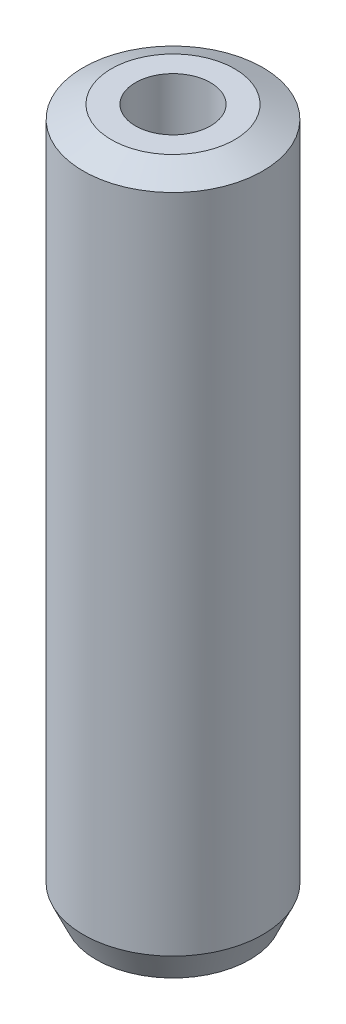
ISO-10303-21;
HEADER;
FILE_DESCRIPTION(('STEP AP214'),'2;1');
FILE_NAME('part.step','',(''),(''),'','','');
FILE_SCHEMA(('AUTOMOTIVE_DESIGN { 1 0 10303 214 1 1 1 1 }'));
ENDSEC;
DATA;
#1=APPLICATION_CONTEXT('core data for automotive mechanical design processes');
#2=APPLICATION_PROTOCOL_DEFINITION('international standard','automotive_design',2000,#1);
#3=PRODUCT_CONTEXT('',#1,'mechanical');
#4=PRODUCT('Part','Part','',(#3));
#5=PRODUCT_RELATED_PRODUCT_CATEGORY('part','',(#4));
#6=PRODUCT_DEFINITION_FORMATION('','',#4);
#7=PRODUCT_DEFINITION_CONTEXT('part definition',#1,'design');
#8=PRODUCT_DEFINITION('design','',#6,#7);
#9=PRODUCT_DEFINITION_SHAPE('','',#8);
#10=(LENGTH_UNIT() NAMED_UNIT(*) SI_UNIT(.MILLI.,.METRE.));
#11=(NAMED_UNIT(*) PLANE_ANGLE_UNIT() SI_UNIT($,.RADIAN.));
#12=(NAMED_UNIT(*) SI_UNIT($,.STERADIAN.) SOLID_ANGLE_UNIT());
#13=UNCERTAINTY_MEASURE_WITH_UNIT(LENGTH_MEASURE(1.E-05),#10,'distance_accuracy_value','');
#14=(GEOMETRIC_REPRESENTATION_CONTEXT(3) GLOBAL_UNCERTAINTY_ASSIGNED_CONTEXT((#13)) GLOBAL_UNIT_ASSIGNED_CONTEXT((#10,
#11,#12)) REPRESENTATION_CONTEXT('',''));
#15=CARTESIAN_POINT('',(0.,0.,0.));
#16=DIRECTION('',(0.,0.,1.));
#17=DIRECTION('',(1.,0.,0.));
#18=AXIS2_PLACEMENT_3D('',#15,#16,#17);
#19=CARTESIAN_POINT('',(0.,313.067838237132,0.));
#20=DIRECTION('',(0.,-1.,0.));
#21=DIRECTION('',(0.,0.,-1.));
#22=AXIS2_PLACEMENT_3D('',#19,#20,#21);
#23=CYLINDRICAL_SURFACE('',#22,40.);
#24=CARTESIAN_POINT('',(0.,307.267377741407,0.));
#25=DIRECTION('',(0.,1.,0.));
#26=DIRECTION('',(0.,0.,1.));
#27=AXIS2_PLACEMENT_3D('',#24,#25,#26);
#28=CIRCLE('',#27,40.);
#29=CARTESIAN_POINT('',(0.,307.267377741407,-40.0000000000001));
#30=VERTEX_POINT('',#29);
#31=EDGE_CURVE('E50',#30,#30,#28,.F.);
#32=ORIENTED_EDGE('',*,*,#31,.T.);
#33=EDGE_LOOP('',(#32));
#34=FACE_BOUND('',#33,.T.);
#35=CARTESIAN_POINT('',(0.,12.5526084067915,0.));
#36=DIRECTION('',(0.,1.,0.));
#37=DIRECTION('',(0.,0.,1.));
#38=AXIS2_PLACEMENT_3D('',#35,#36,#37);
#39=CIRCLE('',#38,40.);
#40=CARTESIAN_POINT('',(0.,12.5526084067915,40.));
#41=VERTEX_POINT('',#40);
#42=EDGE_CURVE('E51',#41,#41,#39,.T.);
#43=ORIENTED_EDGE('',*,*,#42,.T.);
#44=EDGE_LOOP('',(#43));
#45=FACE_BOUND('',#44,.T.);
#46=ADVANCED_FACE('F39',(#34,#45),#23,.T.);
#47=CARTESIAN_POINT('',(0.,313.067838237132,0.));
#48=DIRECTION('',(0.,1.,0.));
#49=DIRECTION('',(0.,0.,1.));
#50=AXIS2_PLACEMENT_3D('',#47,#48,#49);
#51=PLANE('',#50);
#52=CARTESIAN_POINT('',(0.,313.067838237132,0.));
#53=DIRECTION('',(0.,1.,0.));
#54=DIRECTION('',(0.,0.,1.));
#55=AXIS2_PLACEMENT_3D('',#52,#53,#54);
#56=CIRCLE('',#55,27.4473915932084);
#57=CARTESIAN_POINT('',(0.,313.067838237132,-27.4473915932084));
#58=VERTEX_POINT('',#57);
#59=EDGE_CURVE('E54',#58,#58,#56,.T.);
#60=ORIENTED_EDGE('',*,*,#59,.T.);
#61=EDGE_LOOP('',(#60));
#62=FACE_BOUND('',#61,.T.);
#63=CARTESIAN_POINT('',(0.,313.067838237132,0.));
#64=DIRECTION('',(0.,1.,0.));
#65=DIRECTION('',(0.,0.,1.));
#66=AXIS2_PLACEMENT_3D('',#63,#64,#65);
#67=CIRCLE('',#66,16.7352671308477);
#68=CARTESIAN_POINT('',(0.,313.067838237132,16.7352671308477));
#69=VERTEX_POINT('',#68);
#70=EDGE_CURVE('E58',#69,#69,#67,.T.);
#71=ORIENTED_EDGE('',*,*,#70,.F.);
#72=EDGE_LOOP('',(#71));
#73=FACE_BOUND('',#72,.T.);
#74=ADVANCED_FACE('F69',(#62,#73),#51,.T.);
#75=CARTESIAN_POINT('',(0.,0.,0.));
#76=DIRECTION('',(0.,1.,0.));
#77=DIRECTION('',(0.,0.,1.));
#78=AXIS2_PLACEMENT_3D('',#75,#76,#77);
#79=PLANE('',#78);
#80=CARTESIAN_POINT('',(0.,0.,0.));
#81=DIRECTION('',(0.,1.,0.));
#82=DIRECTION('',(0.,0.,1.));
#83=AXIS2_PLACEMENT_3D('',#80,#81,#82);
#84=CIRCLE('',#83,34.1995395042747);
#85=CARTESIAN_POINT('',(0.,0.,34.1995395042747));
#86=VERTEX_POINT('',#85);
#87=EDGE_CURVE('E10',#86,#86,#84,.F.);
#88=ORIENTED_EDGE('',*,*,#87,.T.);
#89=EDGE_LOOP('',(#88));
#90=FACE_BOUND('',#89,.T.);
#91=CARTESIAN_POINT('',(0.,0.,0.));
#92=DIRECTION('',(0.,1.,0.));
#93=DIRECTION('',(0.,0.,1.));
#94=AXIS2_PLACEMENT_3D('',#91,#92,#93);
#95=CIRCLE('',#94,16.7352671308477);
#96=CARTESIAN_POINT('',(0.,0.,16.7352671308477));
#97=VERTEX_POINT('',#96);
#98=EDGE_CURVE('E63',#97,#97,#95,.T.);
#99=ORIENTED_EDGE('',*,*,#98,.T.);
#100=EDGE_LOOP('',(#99));
#101=FACE_BOUND('',#100,.T.);
#102=ADVANCED_FACE('F75',(#90,#101),#79,.F.);
#103=CARTESIAN_POINT('',(0.,313.067838237132,0.));
#104=DIRECTION('',(0.,-1.,0.));
#105=DIRECTION('',(0.,0.,-1.));
#106=AXIS2_PLACEMENT_3D('',#103,#104,#105);
#107=CYLINDRICAL_SURFACE('',#106,16.7352671308477);
#108=ORIENTED_EDGE('',*,*,#70,.T.);
#109=EDGE_LOOP('',(#108));
#110=FACE_BOUND('',#109,.T.);
#111=ORIENTED_EDGE('',*,*,#98,.F.);
#112=EDGE_LOOP('',(#111));
#113=FACE_BOUND('',#112,.T.);
#114=ADVANCED_FACE('F70',(#110,#113),#107,.F.);
#115=CARTESIAN_POINT('',(0.,313.067838237132,0.));
#116=DIRECTION('',(0.,-1.,0.));
#117=DIRECTION('',(0.,0.,-1.));
#118=AXIS2_PLACEMENT_3D('',#115,#116,#117);
#119=CONICAL_SURFACE('',#118,27.4473915932084,1.13793227810062);
#120=CARTESIAN_POINT('',(0.,307.267377741407,-40.0000000000001));
#121=CARTESIAN_POINT('',(0.,307.327799204904,-39.8692436624293));
#122=CARTESIAN_POINT('',(0.,307.388220668401,-39.7384873248586));
#123=CARTESIAN_POINT('',(0.,307.509063595396,-39.4769746497171));
#124=CARTESIAN_POINT('',(0.,307.569485058893,-39.3462183121463));
#125=CARTESIAN_POINT('',(0.,307.690327985887,-39.0847056370048));
#126=CARTESIAN_POINT('',(0.,307.750749449384,-38.9539492994341));
#127=CARTESIAN_POINT('',(0.,307.871592376378,-38.6924366242926));
#128=CARTESIAN_POINT('',(0.,307.932013839876,-38.5616802867219));
#129=CARTESIAN_POINT('',(0.,308.05285676687,-38.3001676115804));
#130=CARTESIAN_POINT('',(0.,308.113278230367,-38.1694112740096));
#131=CARTESIAN_POINT('',(0.,308.234121157361,-37.9078985988681));
#132=CARTESIAN_POINT('',(0.,308.294542620858,-37.7771422612974));
#133=CARTESIAN_POINT('',(0.,308.415385547853,-37.5156295861559));
#134=CARTESIAN_POINT('',(0.,308.47580701135,-37.3848732485851));
#135=CARTESIAN_POINT('',(0.,308.596649938344,-37.1233605734436));
#136=CARTESIAN_POINT('',(0.,308.657071401841,-36.9926042358729));
#137=CARTESIAN_POINT('',(0.,308.777914328836,-36.7310915607314));
#138=CARTESIAN_POINT('',(0.,308.838335792333,-36.6003352231607));
#139=CARTESIAN_POINT('',(0.,308.959178719327,-36.3388225480192));
#140=CARTESIAN_POINT('',(0.,309.019600182824,-36.2080662104484));
#141=CARTESIAN_POINT('',(0.,309.140443109818,-35.9465535353069));
#142=CARTESIAN_POINT('',(0.,309.200864573315,-35.8157971977362));
#143=CARTESIAN_POINT('',(0.,309.32170750031,-35.5542845225947));
#144=CARTESIAN_POINT('',(0.,309.382128963807,-35.4235281850239));
#145=CARTESIAN_POINT('',(0.,309.502971890801,-35.1620155098824));
#146=CARTESIAN_POINT('',(0.,309.563393354298,-35.0312591723117));
#147=CARTESIAN_POINT('',(0.,309.684236281293,-34.7697464971702));
#148=CARTESIAN_POINT('',(0.,309.74465774479,-34.6389901595995));
#149=CARTESIAN_POINT('',(0.,309.865500671784,-34.377477484458));
#150=CARTESIAN_POINT('',(0.,309.925922135281,-34.2467211468872));
#151=CARTESIAN_POINT('',(0.,310.046765062275,-33.9852084717457));
#152=CARTESIAN_POINT('',(0.,310.107186525773,-33.854452134175));
#153=CARTESIAN_POINT('',(0.,310.228029452767,-33.5929394590335));
#154=CARTESIAN_POINT('',(0.,310.288450916264,-33.4621831214628));
#155=CARTESIAN_POINT('',(0.,310.409293843258,-33.2006704463213));
#156=CARTESIAN_POINT('',(0.,310.469715306755,-33.0699141087505));
#157=CARTESIAN_POINT('',(0.,310.59055823375,-32.808401433609));
#158=CARTESIAN_POINT('',(0.,310.650979697247,-32.6776450960383));
#159=CARTESIAN_POINT('',(0.,310.771822624241,-32.4161324208968));
#160=CARTESIAN_POINT('',(0.,310.832244087738,-32.285376083326));
#161=CARTESIAN_POINT('',(0.,310.953087014733,-32.0238634081845));
#162=CARTESIAN_POINT('',(0.,311.01350847823,-31.8931070706138));
#163=CARTESIAN_POINT('',(0.,311.134351405224,-31.6315943954723));
#164=CARTESIAN_POINT('',(0.,311.194772868721,-31.5008380579016));
#165=CARTESIAN_POINT('',(0.,311.315615795715,-31.2393253827601));
#166=CARTESIAN_POINT('',(0.,311.376037259213,-31.1085690451893));
#167=CARTESIAN_POINT('',(0.,311.496880186207,-30.8470563700478));
#168=CARTESIAN_POINT('',(0.,311.557301649704,-30.7163000324771));
#169=CARTESIAN_POINT('',(0.,311.678144576698,-30.4547873573356));
#170=CARTESIAN_POINT('',(0.,311.738566040195,-30.3240310197648));
#171=CARTESIAN_POINT('',(0.,311.85940896719,-30.0625183446233));
#172=CARTESIAN_POINT('',(0.,311.919830430687,-29.9317620070526));
#173=CARTESIAN_POINT('',(0.,312.040673357681,-29.6702493319111));
#174=CARTESIAN_POINT('',(0.,312.101094821178,-29.5394929943404));
#175=CARTESIAN_POINT('',(0.,312.221937748172,-29.2779803191989));
#176=CARTESIAN_POINT('',(0.,312.28235921167,-29.1472239816281));
#177=CARTESIAN_POINT('',(0.,312.403202138664,-28.8857113064866));
#178=CARTESIAN_POINT('',(0.,312.463623602161,-28.7549549689159));
#179=CARTESIAN_POINT('',(0.,312.584466529155,-28.4934422937744));
#180=CARTESIAN_POINT('',(0.,312.644887992652,-28.3626859562036));
#181=CARTESIAN_POINT('',(0.,312.765730919647,-28.1011732810621));
#182=CARTESIAN_POINT('',(0.,312.826152383144,-27.9704169434914));
#183=CARTESIAN_POINT('',(0.,312.946995310138,-27.7089042683499));
#184=CARTESIAN_POINT('',(0.,313.007416773635,-27.5781479307792));
#185=CARTESIAN_POINT('',(0.,313.067838237132,-27.4473915932084));
#186=B_SPLINE_CURVE_WITH_KNOTS('',3,(#120,#121,#122,#123,#124,#125,#126,#127,#128,#129,#130,
#131,#132,#133,#134,#135,#136,#137,#138,#139,#140,#141,#142,#143,#144,#145,#146,#147,#148,#149,
#150,#151,#152,#153,#154,#155,#156,#157,#158,#159,#160,#161,#162,#163,#164,#165,#166,#167,#168,
#169,#170,#171,#172,#173,#174,#175,#176,#177,#178,#179,#180,#181,#182,#183,#184,#185),
.UNSPECIFIED.,.F.,.F.,(4,2,2,2,2,2,2,2,2,2,2,2,2,2,2,2,2,2,2,2,2,2,2,2,2,2,2,2,2,2,2,2,4),(0.,
0.432124701439812,0.864249402879647,1.29637410431948,1.72849880575931,2.16062350719912,
2.59274820863895,3.02487291007879,3.45699761151862,3.88912231295845,4.32124701439826,
4.7533717158381,5.18549641727793,5.61762111871776,6.04974582015757,6.4818705215974,
6.91399522303724,7.34611992447707,7.7782446259169,8.21036932735671,8.64249402879654,
9.07461873023638,9.50674343167621,9.93886813311602,10.3709928345559,10.8031175359957,
11.2352422374355,11.6673669388754,12.0994916403152,12.531616341755,12.9637410431948,
13.3958657446347,13.8279904460745),.UNSPECIFIED.);
#187=EDGE_CURVE('BSEAM81',#30,#58,#186,.T.);
#188=ORIENTED_EDGE('',*,*,#31,.F.);
#189=ORIENTED_EDGE('',*,*,#59,.F.);
#190=ORIENTED_EDGE('',*,*,#187,.T.);
#191=ORIENTED_EDGE('',*,*,#187,.F.);
#192=EDGE_LOOP('',(#188,#190,#189,#191));
#193=FACE_BOUND('',#192,.T.);
#194=ADVANCED_FACE('F81',(#193),#119,.T.);
#195=CARTESIAN_POINT('',(0.,12.5526084067915,0.));
#196=DIRECTION('',(0.,1.,0.));
#197=DIRECTION('',(0.,0.,1.));
#198=AXIS2_PLACEMENT_3D('',#195,#196,#197);
#199=CONICAL_SURFACE('',#198,40.,0.432864048694272);
#200=ORIENTED_EDGE('',*,*,#87,.F.);
#201=EDGE_LOOP('',(#200));
#202=FACE_BOUND('',#201,.T.);
#203=ORIENTED_EDGE('',*,*,#42,.F.);
#204=EDGE_LOOP('',(#203));
#205=FACE_BOUND('',#204,.T.);
#206=ADVANCED_FACE('F45',(#202,#205),#199,.T.);
#207=CLOSED_SHELL('',(#46,#74,#102,#114,#194,#206));
#208=MANIFOLD_SOLID_BREP('B2',#207);
#209=ADVANCED_BREP_SHAPE_REPRESENTATION('',(#18,#208),#14);
#210=SHAPE_DEFINITION_REPRESENTATION(#9,#209);
ENDSEC;
END-ISO-10303-21;
